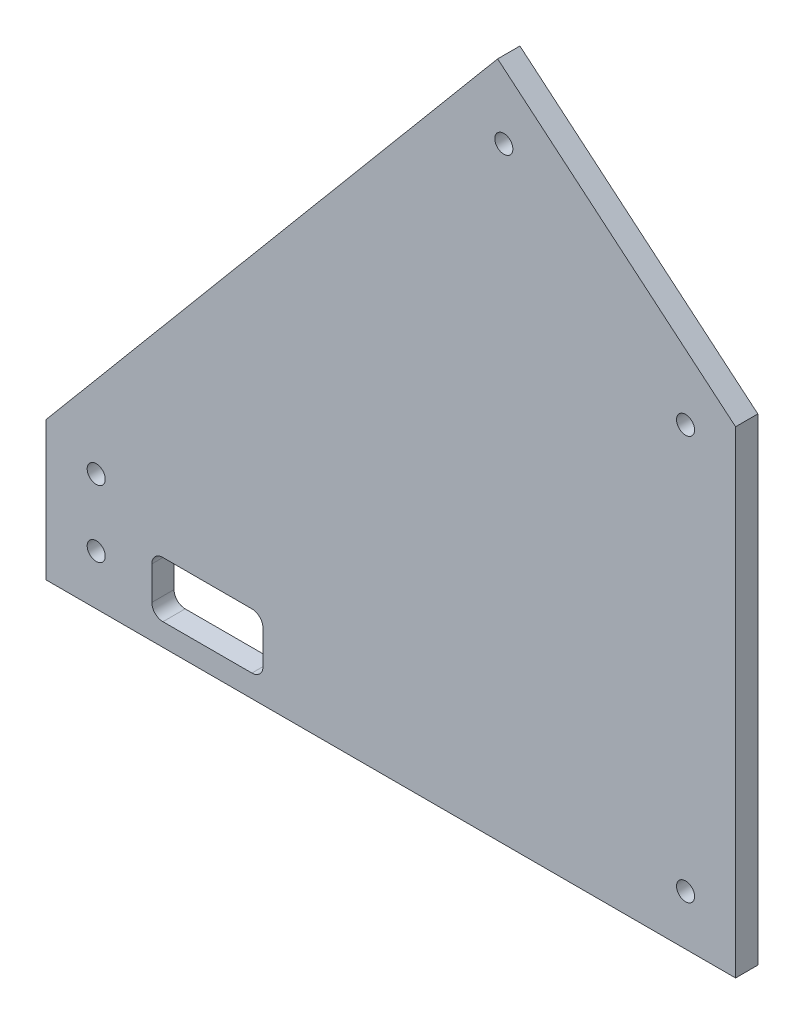
ISO-10303-21;
HEADER;
FILE_DESCRIPTION(('STEP AP214'),'2;1');
FILE_NAME('part.step','',(''),(''),'','','');
FILE_SCHEMA(('AUTOMOTIVE_DESIGN { 1 0 10303 214 1 1 1 1 }'));
ENDSEC;
DATA;
#1=APPLICATION_CONTEXT('core data for automotive mechanical design processes');
#2=APPLICATION_PROTOCOL_DEFINITION('international standard','automotive_design',2000,#1);
#3=PRODUCT_CONTEXT('',#1,'mechanical');
#4=PRODUCT('Part','Part','',(#3));
#5=PRODUCT_RELATED_PRODUCT_CATEGORY('part','',(#4));
#6=PRODUCT_DEFINITION_FORMATION('','',#4);
#7=PRODUCT_DEFINITION_CONTEXT('part definition',#1,'design');
#8=PRODUCT_DEFINITION('design','',#6,#7);
#9=PRODUCT_DEFINITION_SHAPE('','',#8);
#10=(LENGTH_UNIT() NAMED_UNIT(*) SI_UNIT(.MILLI.,.METRE.));
#11=(NAMED_UNIT(*) PLANE_ANGLE_UNIT() SI_UNIT($,.RADIAN.));
#12=(NAMED_UNIT(*) SI_UNIT($,.STERADIAN.) SOLID_ANGLE_UNIT());
#13=UNCERTAINTY_MEASURE_WITH_UNIT(LENGTH_MEASURE(1.E-05),#10,'distance_accuracy_value','');
#14=(GEOMETRIC_REPRESENTATION_CONTEXT(3) GLOBAL_UNCERTAINTY_ASSIGNED_CONTEXT((#13)) GLOBAL_UNIT_ASSIGNED_CONTEXT((#10,
#11,#12)) REPRESENTATION_CONTEXT('',''));
#15=CARTESIAN_POINT('',(0.,0.,0.));
#16=DIRECTION('',(0.,0.,1.));
#17=DIRECTION('',(1.,0.,0.));
#18=AXIS2_PLACEMENT_3D('',#15,#16,#17);
#19=CARTESIAN_POINT('',(0.,9.99999999999999,4.));
#20=DIRECTION('',(0.,1.,0.));
#21=DIRECTION('',(0.,0.,1.));
#22=AXIS2_PLACEMENT_3D('',#19,#20,#21);
#23=PLANE('',#22);
#24=DIRECTION('',(1.,0.,0.));
#25=VECTOR('',#24,1.);
#26=CARTESIAN_POINT('',(0.,9.99999999999999,0.));
#27=LINE('',#26,#25);
#28=CARTESIAN_POINT('',(-99.,9.99999999999999,0.));
#29=VERTEX_POINT('',#28);
#30=CARTESIAN_POINT('',(-83.,9.99999999999999,0.));
#31=VERTEX_POINT('',#30);
#32=EDGE_CURVE('E220',#29,#31,#27,.T.);
#33=ORIENTED_EDGE('',*,*,#32,.T.);
#34=DIRECTION('',(0.,0.,-1.));
#35=VECTOR('',#34,1.);
#36=CARTESIAN_POINT('',(-83.,9.99999999999999,4.));
#37=LINE('',#36,#35);
#38=CARTESIAN_POINT('',(-83.,9.99999999999999,4.));
#39=VERTEX_POINT('',#38);
#40=EDGE_CURVE('E245',#31,#39,#37,.F.);
#41=ORIENTED_EDGE('',*,*,#40,.T.);
#42=DIRECTION('',(1.,0.,0.));
#43=VECTOR('',#42,1.);
#44=CARTESIAN_POINT('',(0.,9.99999999999999,4.));
#45=LINE('',#44,#43);
#46=CARTESIAN_POINT('',(-99.,9.99999999999999,4.));
#47=VERTEX_POINT('',#46);
#48=EDGE_CURVE('E181',#47,#39,#45,.T.);
#49=ORIENTED_EDGE('',*,*,#48,.F.);
#50=DIRECTION('',(0.,0.,-1.));
#51=VECTOR('',#50,1.);
#52=CARTESIAN_POINT('',(-99.,9.99999999999999,4.));
#53=LINE('',#52,#51);
#54=EDGE_CURVE('E242',#47,#29,#53,.T.);
#55=ORIENTED_EDGE('',*,*,#54,.T.);
#56=EDGE_LOOP('',(#33,#41,#49,#55));
#57=FACE_BOUND('',#56,.T.);
#58=ADVANCED_FACE('F37',(#57),#23,.F.);
#59=CARTESIAN_POINT('',(-81.,0.,4.));
#60=DIRECTION('',(1.,0.,0.));
#61=DIRECTION('',(0.,0.,-1.));
#62=AXIS2_PLACEMENT_3D('',#59,#60,#61);
#63=PLANE('',#62);
#64=DIRECTION('',(0.,-1.,0.));
#65=VECTOR('',#64,1.);
#66=CARTESIAN_POINT('',(-81.,0.,4.));
#67=LINE('',#66,#65);
#68=CARTESIAN_POINT('',(-81.,7.99999999999999,4.));
#69=VERTEX_POINT('',#68);
#70=CARTESIAN_POINT('',(-81.,2.,4.));
#71=VERTEX_POINT('',#70);
#72=EDGE_CURVE('E184',#69,#71,#67,.T.);
#73=ORIENTED_EDGE('',*,*,#72,.F.);
#74=DIRECTION('',(0.,0.,-1.));
#75=VECTOR('',#74,1.);
#76=CARTESIAN_POINT('',(-81.,7.99999999999999,0.));
#77=LINE('',#76,#75);
#78=CARTESIAN_POINT('',(-81.,7.99999999999999,0.));
#79=VERTEX_POINT('',#78);
#80=EDGE_CURVE('E239',#69,#79,#77,.T.);
#81=ORIENTED_EDGE('',*,*,#80,.T.);
#82=DIRECTION('',(0.,-1.,0.));
#83=VECTOR('',#82,1.);
#84=CARTESIAN_POINT('',(-81.,0.,0.));
#85=LINE('',#84,#83);
#86=CARTESIAN_POINT('',(-81.,2.,0.));
#87=VERTEX_POINT('',#86);
#88=EDGE_CURVE('E223',#79,#87,#85,.T.);
#89=ORIENTED_EDGE('',*,*,#88,.T.);
#90=DIRECTION('',(0.,0.,-1.));
#91=VECTOR('',#90,1.);
#92=CARTESIAN_POINT('',(-81.,2.,4.));
#93=LINE('',#92,#91);
#94=EDGE_CURVE('E144',#87,#71,#93,.F.);
#95=ORIENTED_EDGE('',*,*,#94,.T.);
#96=EDGE_LOOP('',(#73,#81,#89,#95));
#97=FACE_BOUND('',#96,.T.);
#98=ADVANCED_FACE('F284',(#97),#63,.F.);
#99=CARTESIAN_POINT('',(0.,0.,4.));
#100=DIRECTION('',(0.,1.,0.));
#101=DIRECTION('',(-1.,0.,0.));
#102=AXIS2_PLACEMENT_3D('',#99,#100,#101);
#103=PLANE('',#102);
#104=DIRECTION('',(1.,0.,0.));
#105=VECTOR('',#104,1.);
#106=CARTESIAN_POINT('',(0.,0.,4.));
#107=LINE('',#106,#105);
#108=CARTESIAN_POINT('',(-99.,0.,4.));
#109=VERTEX_POINT('',#108);
#110=CARTESIAN_POINT('',(-83.,0.,4.));
#111=VERTEX_POINT('',#110);
#112=EDGE_CURVE('E187',#109,#111,#107,.T.);
#113=ORIENTED_EDGE('',*,*,#112,.T.);
#114=DIRECTION('',(0.,0.,-1.));
#115=VECTOR('',#114,1.);
#116=CARTESIAN_POINT('',(-83.,0.,4.));
#117=LINE('',#116,#115);
#118=CARTESIAN_POINT('',(-83.,0.,0.));
#119=VERTEX_POINT('',#118);
#120=EDGE_CURVE('E249',#111,#119,#117,.T.);
#121=ORIENTED_EDGE('',*,*,#120,.T.);
#122=DIRECTION('',(1.,0.,0.));
#123=VECTOR('',#122,1.);
#124=CARTESIAN_POINT('',(0.,0.,0.));
#125=LINE('',#124,#123);
#126=CARTESIAN_POINT('',(-99.,0.,0.));
#127=VERTEX_POINT('',#126);
#128=EDGE_CURVE('E226',#127,#119,#125,.T.);
#129=ORIENTED_EDGE('',*,*,#128,.F.);
#130=DIRECTION('',(0.,0.,-1.));
#131=VECTOR('',#130,1.);
#132=CARTESIAN_POINT('',(-99.,0.,4.));
#133=LINE('',#132,#131);
#134=EDGE_CURVE('E247',#127,#109,#133,.F.);
#135=ORIENTED_EDGE('',*,*,#134,.T.);
#136=EDGE_LOOP('',(#113,#121,#129,#135));
#137=FACE_BOUND('',#136,.T.);
#138=ADVANCED_FACE('F291',(#137),#103,.T.);
#139=CARTESIAN_POINT('',(4.,0.,4.));
#140=DIRECTION('',(1.,0.,0.));
#141=DIRECTION('',(0.,1.,0.));
#142=AXIS2_PLACEMENT_3D('',#139,#140,#141);
#143=PLANE('',#142);
#144=DIRECTION('',(0.,-1.,0.));
#145=VECTOR('',#144,1.);
#146=CARTESIAN_POINT('',(4.,0.,0.));
#147=LINE('',#146,#145);
#148=CARTESIAN_POINT('',(3.99999999999999,81.86523063262,0.));
#149=VERTEX_POINT('',#148);
#150=CARTESIAN_POINT('',(4.,-4.,0.));
#151=VERTEX_POINT('',#150);
#152=EDGE_CURVE('E139',#149,#151,#147,.T.);
#153=ORIENTED_EDGE('',*,*,#152,.F.);
#154=DIRECTION('',(0.,0.,-1.));
#155=VECTOR('',#154,1.);
#156=CARTESIAN_POINT('',(3.99999999999999,81.86523063262,4.));
#157=LINE('',#156,#155);
#158=CARTESIAN_POINT('',(3.99999999999999,81.86523063262,4.));
#159=VERTEX_POINT('',#158);
#160=EDGE_CURVE('E133',#159,#149,#157,.T.);
#161=ORIENTED_EDGE('',*,*,#160,.F.);
#162=DIRECTION('',(0.,-1.,0.));
#163=VECTOR('',#162,1.);
#164=CARTESIAN_POINT('',(4.,0.,4.));
#165=LINE('',#164,#163);
#166=CARTESIAN_POINT('',(4.,-4.,4.));
#167=VERTEX_POINT('',#166);
#168=EDGE_CURVE('E136',#159,#167,#165,.T.);
#169=ORIENTED_EDGE('',*,*,#168,.T.);
#170=DIRECTION('',(0.,0.,-1.));
#171=VECTOR('',#170,1.);
#172=CARTESIAN_POINT('',(4.,-4.,4.));
#173=LINE('',#172,#171);
#174=EDGE_CURVE('E192',#167,#151,#173,.T.);
#175=ORIENTED_EDGE('',*,*,#174,.T.);
#176=EDGE_LOOP('',(#153,#161,#169,#175));
#177=FACE_BOUND('',#176,.T.);
#178=ADVANCED_FACE('F135',(#177),#143,.T.);
#179=CARTESIAN_POINT('',(41.9634605592344,50.0101048791536,4.));
#180=DIRECTION('',(0.642787609686535,0.766044443118982,0.));
#181=DIRECTION('',(-0.766044443118982,0.642787609686535,0.));
#182=AXIS2_PLACEMENT_3D('',#179,#180,#181);
#183=PLANE('',#182);
#184=DIRECTION('',(0.766044443118982,-0.642787609686535,0.));
#185=VECTOR('',#184,1.);
#186=CARTESIAN_POINT('',(41.9634605592344,50.0101048791536,0.));
#187=LINE('',#186,#185);
#188=CARTESIAN_POINT('',(-38.7952494896789,117.774708695549,0.));
#189=VERTEX_POINT('',#188);
#190=EDGE_CURVE('E197',#189,#149,#187,.T.);
#191=ORIENTED_EDGE('',*,*,#190,.F.);
#192=DIRECTION('',(0.,0.,-1.));
#193=VECTOR('',#192,1.);
#194=CARTESIAN_POINT('',(-38.7952494896789,117.774708695549,4.));
#195=LINE('',#194,#193);
#196=CARTESIAN_POINT('',(-38.7952494896789,117.774708695549,4.));
#197=VERTEX_POINT('',#196);
#198=EDGE_CURVE('E145',#197,#189,#195,.T.);
#199=ORIENTED_EDGE('',*,*,#198,.F.);
#200=DIRECTION('',(0.766044443118982,-0.642787609686535,0.));
#201=VECTOR('',#200,1.);
#202=CARTESIAN_POINT('',(41.9634605592344,50.0101048791536,4.));
#203=LINE('',#202,#201);
#204=EDGE_CURVE('E152',#197,#159,#203,.T.);
#205=ORIENTED_EDGE('',*,*,#204,.T.);
#206=ORIENTED_EDGE('',*,*,#160,.T.);
#207=EDGE_LOOP('',(#191,#199,#205,#206));
#208=FACE_BOUND('',#207,.T.);
#209=ADVANCED_FACE('F159',(#208),#183,.T.);
#210=CARTESIAN_POINT('',(-80.7587100489132,67.7646038163952,4.));
#211=DIRECTION('',(-0.766044443118982,0.642787609686535,0.));
#212=DIRECTION('',(-0.642787609686535,-0.766044443118982,0.));
#213=AXIS2_PLACEMENT_3D('',#210,#211,#212);
#214=PLANE('',#213);
#215=DIRECTION('',(0.642787609686535,0.766044443118982,0.));
#216=VECTOR('',#215,1.);
#217=CARTESIAN_POINT('',(-80.7587100489132,67.7646038163952,0.));
#218=LINE('',#217,#216);
#219=CARTESIAN_POINT('',(-120.,20.998655539156,0.));
#220=VERTEX_POINT('',#219);
#221=EDGE_CURVE('E199',#220,#189,#218,.T.);
#222=ORIENTED_EDGE('',*,*,#221,.F.);
#223=DIRECTION('',(0.,0.,-1.));
#224=VECTOR('',#223,1.);
#225=CARTESIAN_POINT('',(-120.,20.998655539156,4.));
#226=LINE('',#225,#224);
#227=CARTESIAN_POINT('',(-120.,20.998655539156,4.));
#228=VERTEX_POINT('',#227);
#229=EDGE_CURVE('E235',#228,#220,#226,.T.);
#230=ORIENTED_EDGE('',*,*,#229,.F.);
#231=DIRECTION('',(0.642787609686535,0.766044443118982,0.));
#232=VECTOR('',#231,1.);
#233=CARTESIAN_POINT('',(-80.7587100489132,67.7646038163952,4.));
#234=LINE('',#233,#232);
#235=EDGE_CURVE('E160',#228,#197,#234,.T.);
#236=ORIENTED_EDGE('',*,*,#235,.T.);
#237=ORIENTED_EDGE('',*,*,#198,.T.);
#238=EDGE_LOOP('',(#222,#230,#236,#237));
#239=FACE_BOUND('',#238,.T.);
#240=ADVANCED_FACE('F334',(#239),#214,.T.);
#241=CARTESIAN_POINT('',(-120.,0.,4.));
#242=DIRECTION('',(-1.,0.,0.));
#243=DIRECTION('',(0.,0.,1.));
#244=AXIS2_PLACEMENT_3D('',#241,#242,#243);
#245=PLANE('',#244);
#246=DIRECTION('',(0.,1.,0.));
#247=VECTOR('',#246,1.);
#248=CARTESIAN_POINT('',(-120.,0.,0.));
#249=LINE('',#248,#247);
#250=CARTESIAN_POINT('',(-120.,-4.00000000000002,0.));
#251=VERTEX_POINT('',#250);
#252=EDGE_CURVE('E202',#251,#220,#249,.T.);
#253=ORIENTED_EDGE('',*,*,#252,.F.);
#254=DIRECTION('',(0.,0.,-1.));
#255=VECTOR('',#254,1.);
#256=CARTESIAN_POINT('',(-120.,-4.00000000000002,4.));
#257=LINE('',#256,#255);
#258=CARTESIAN_POINT('',(-120.,-4.00000000000002,4.));
#259=VERTEX_POINT('',#258);
#260=EDGE_CURVE('E233',#259,#251,#257,.T.);
#261=ORIENTED_EDGE('',*,*,#260,.F.);
#262=DIRECTION('',(0.,1.,0.));
#263=VECTOR('',#262,1.);
#264=CARTESIAN_POINT('',(-120.,0.,4.));
#265=LINE('',#264,#263);
#266=EDGE_CURVE('E162',#259,#228,#265,.T.);
#267=ORIENTED_EDGE('',*,*,#266,.T.);
#268=ORIENTED_EDGE('',*,*,#229,.T.);
#269=EDGE_LOOP('',(#253,#261,#267,#268));
#270=FACE_BOUND('',#269,.T.);
#271=ADVANCED_FACE('F314',(#270),#245,.T.);
#272=CARTESIAN_POINT('',(-5.,5.,4.));
#273=DIRECTION('',(0.,0.,-1.));
#274=DIRECTION('',(-1.,0.,0.));
#275=AXIS2_PLACEMENT_3D('',#272,#273,#274);
#276=CYLINDRICAL_SURFACE('',#275,1.625);
#277=CARTESIAN_POINT('',(-5.,5.,4.));
#278=DIRECTION('',(0.,0.,1.));
#279=DIRECTION('',(1.,0.,0.));
#280=AXIS2_PLACEMENT_3D('',#277,#278,#279);
#281=CIRCLE('',#280,1.625);
#282=CARTESIAN_POINT('',(-3.375,5.,4.));
#283=VERTEX_POINT('',#282);
#284=EDGE_CURVE('E178',#283,#283,#281,.T.);
#285=ORIENTED_EDGE('',*,*,#284,.T.);
#286=EDGE_LOOP('',(#285));
#287=FACE_BOUND('',#286,.T.);
#288=CARTESIAN_POINT('',(-5.,5.,0.));
#289=DIRECTION('',(0.,0.,1.));
#290=DIRECTION('',(1.,0.,0.));
#291=AXIS2_PLACEMENT_3D('',#288,#289,#290);
#292=CIRCLE('',#291,1.625);
#293=CARTESIAN_POINT('',(-3.375,5.,0.));
#294=VERTEX_POINT('',#293);
#295=EDGE_CURVE('E217',#294,#294,#292,.T.);
#296=ORIENTED_EDGE('',*,*,#295,.F.);
#297=EDGE_LOOP('',(#296));
#298=FACE_BOUND('',#297,.T.);
#299=ADVANCED_FACE('F310',(#287,#298),#276,.F.);
#300=CARTESIAN_POINT('',(-111.,17.,4.));
#301=DIRECTION('',(0.,0.,-1.));
#302=DIRECTION('',(-1.,0.,0.));
#303=AXIS2_PLACEMENT_3D('',#300,#301,#302);
#304=CYLINDRICAL_SURFACE('',#303,1.625);
#305=CARTESIAN_POINT('',(-111.,17.,4.));
#306=DIRECTION('',(0.,0.,1.));
#307=DIRECTION('',(1.,0.,0.));
#308=AXIS2_PLACEMENT_3D('',#305,#306,#307);
#309=CIRCLE('',#308,1.625);
#310=CARTESIAN_POINT('',(-109.375,17.,4.));
#311=VERTEX_POINT('',#310);
#312=EDGE_CURVE('E175',#311,#311,#309,.T.);
#313=ORIENTED_EDGE('',*,*,#312,.T.);
#314=EDGE_LOOP('',(#313));
#315=FACE_BOUND('',#314,.T.);
#316=CARTESIAN_POINT('',(-111.,17.,0.));
#317=DIRECTION('',(0.,0.,1.));
#318=DIRECTION('',(1.,0.,0.));
#319=AXIS2_PLACEMENT_3D('',#316,#317,#318);
#320=CIRCLE('',#319,1.625);
#321=CARTESIAN_POINT('',(-109.375,17.,0.));
#322=VERTEX_POINT('',#321);
#323=EDGE_CURVE('E214',#322,#322,#320,.T.);
#324=ORIENTED_EDGE('',*,*,#323,.F.);
#325=EDGE_LOOP('',(#324));
#326=FACE_BOUND('',#325,.T.);
#327=ADVANCED_FACE('F313',(#315,#326),#304,.F.);
#328=CARTESIAN_POINT('',(-37.6859379887868,105.095220220299,4.));
#329=DIRECTION('',(0.,0.,-1.));
#330=DIRECTION('',(-1.,0.,0.));
#331=AXIS2_PLACEMENT_3D('',#328,#329,#330);
#332=CYLINDRICAL_SURFACE('',#331,1.625);
#333=CARTESIAN_POINT('',(-37.6859379887868,105.095220220299,4.));
#334=DIRECTION('',(0.,0.,1.));
#335=DIRECTION('',(1.,0.,0.));
#336=AXIS2_PLACEMENT_3D('',#333,#334,#335);
#337=CIRCLE('',#336,1.625);
#338=CARTESIAN_POINT('',(-36.0609379887868,105.095220220299,4.));
#339=VERTEX_POINT('',#338);
#340=EDGE_CURVE('E172',#339,#339,#337,.T.);
#341=ORIENTED_EDGE('',*,*,#340,.T.);
#342=EDGE_LOOP('',(#341));
#343=FACE_BOUND('',#342,.T.);
#344=CARTESIAN_POINT('',(-37.6859379887868,105.095220220299,0.));
#345=DIRECTION('',(0.,0.,1.));
#346=DIRECTION('',(1.,0.,0.));
#347=AXIS2_PLACEMENT_3D('',#344,#345,#346);
#348=CIRCLE('',#347,1.625);
#349=CARTESIAN_POINT('',(-36.0609379887868,105.095220220299,0.));
#350=VERTEX_POINT('',#349);
#351=EDGE_CURVE('E211',#350,#350,#348,.T.);
#352=ORIENTED_EDGE('',*,*,#351,.F.);
#353=EDGE_LOOP('',(#352));
#354=FACE_BOUND('',#353,.T.);
#355=ADVANCED_FACE('F318',(#343,#354),#332,.F.);
#356=CARTESIAN_POINT('',(-4.99999999999999,77.668461709225,4.));
#357=DIRECTION('',(0.,0.,-1.));
#358=DIRECTION('',(-1.,0.,0.));
#359=AXIS2_PLACEMENT_3D('',#356,#357,#358);
#360=CYLINDRICAL_SURFACE('',#359,1.625);
#361=CARTESIAN_POINT('',(-4.99999999999999,77.668461709225,4.));
#362=DIRECTION('',(0.,0.,1.));
#363=DIRECTION('',(1.,0.,0.));
#364=AXIS2_PLACEMENT_3D('',#361,#362,#363);
#365=CIRCLE('',#364,1.625);
#366=CARTESIAN_POINT('',(-3.37499999999999,77.668461709225,4.));
#367=VERTEX_POINT('',#366);
#368=EDGE_CURVE('E169',#367,#367,#365,.T.);
#369=ORIENTED_EDGE('',*,*,#368,.T.);
#370=EDGE_LOOP('',(#369));
#371=FACE_BOUND('',#370,.T.);
#372=CARTESIAN_POINT('',(-4.99999999999999,77.668461709225,0.));
#373=DIRECTION('',(0.,0.,1.));
#374=DIRECTION('',(1.,0.,0.));
#375=AXIS2_PLACEMENT_3D('',#372,#373,#374);
#376=CIRCLE('',#375,1.625);
#377=CARTESIAN_POINT('',(-3.37499999999999,77.668461709225,0.));
#378=VERTEX_POINT('',#377);
#379=EDGE_CURVE('E208',#378,#378,#376,.T.);
#380=ORIENTED_EDGE('',*,*,#379,.F.);
#381=EDGE_LOOP('',(#380));
#382=FACE_BOUND('',#381,.T.);
#383=ADVANCED_FACE('F322',(#371,#382),#360,.F.);
#384=CARTESIAN_POINT('',(0.,-4.,4.));
#385=DIRECTION('',(0.,-1.,0.));
#386=DIRECTION('',(1.,0.,0.));
#387=AXIS2_PLACEMENT_3D('',#384,#385,#386);
#388=PLANE('',#387);
#389=DIRECTION('',(-1.,0.,0.));
#390=VECTOR('',#389,1.);
#391=CARTESIAN_POINT('',(0.,-4.,0.));
#392=LINE('',#391,#390);
#393=EDGE_CURVE('E205',#151,#251,#392,.T.);
#394=ORIENTED_EDGE('',*,*,#393,.F.);
#395=ORIENTED_EDGE('',*,*,#174,.F.);
#396=DIRECTION('',(-1.,0.,0.));
#397=VECTOR('',#396,1.);
#398=CARTESIAN_POINT('',(0.,-4.,4.));
#399=LINE('',#398,#397);
#400=EDGE_CURVE('E156',#167,#259,#399,.T.);
#401=ORIENTED_EDGE('',*,*,#400,.T.);
#402=ORIENTED_EDGE('',*,*,#260,.T.);
#403=EDGE_LOOP('',(#394,#395,#401,#402));
#404=FACE_BOUND('',#403,.T.);
#405=ADVANCED_FACE('F326',(#404),#388,.T.);
#406=CARTESIAN_POINT('',(-111.,5.,4.));
#407=DIRECTION('',(0.,0.,-1.));
#408=DIRECTION('',(-1.,0.,0.));
#409=AXIS2_PLACEMENT_3D('',#406,#407,#408);
#410=CYLINDRICAL_SURFACE('',#409,1.625);
#411=CARTESIAN_POINT('',(-111.,5.,4.));
#412=DIRECTION('',(0.,0.,1.));
#413=DIRECTION('',(1.,0.,0.));
#414=AXIS2_PLACEMENT_3D('',#411,#412,#413);
#415=CIRCLE('',#414,1.625);
#416=CARTESIAN_POINT('',(-109.375,5.,4.));
#417=VERTEX_POINT('',#416);
#418=EDGE_CURVE('E157',#417,#417,#415,.T.);
#419=ORIENTED_EDGE('',*,*,#418,.T.);
#420=EDGE_LOOP('',(#419));
#421=FACE_BOUND('',#420,.T.);
#422=CARTESIAN_POINT('',(-111.,5.,0.));
#423=DIRECTION('',(0.,0.,1.));
#424=DIRECTION('',(1.,0.,0.));
#425=AXIS2_PLACEMENT_3D('',#422,#423,#424);
#426=CIRCLE('',#425,1.625);
#427=CARTESIAN_POINT('',(-109.375,5.,0.));
#428=VERTEX_POINT('',#427);
#429=EDGE_CURVE('E193',#428,#428,#426,.T.);
#430=ORIENTED_EDGE('',*,*,#429,.F.);
#431=EDGE_LOOP('',(#430));
#432=FACE_BOUND('',#431,.T.);
#433=ADVANCED_FACE('F330',(#421,#432),#410,.F.);
#434=CARTESIAN_POINT('',(-101.,0.,4.));
#435=DIRECTION('',(1.,0.,0.));
#436=DIRECTION('',(0.,0.,-1.));
#437=AXIS2_PLACEMENT_3D('',#434,#435,#436);
#438=PLANE('',#437);
#439=DIRECTION('',(0.,-1.,0.));
#440=VECTOR('',#439,1.);
#441=CARTESIAN_POINT('',(-101.,0.,4.));
#442=LINE('',#441,#440);
#443=CARTESIAN_POINT('',(-101.,7.99999999999999,4.));
#444=VERTEX_POINT('',#443);
#445=CARTESIAN_POINT('',(-101.,2.,4.));
#446=VERTEX_POINT('',#445);
#447=EDGE_CURVE('E190',#444,#446,#442,.T.);
#448=ORIENTED_EDGE('',*,*,#447,.T.);
#449=DIRECTION('',(0.,0.,-1.));
#450=VECTOR('',#449,1.);
#451=CARTESIAN_POINT('',(-101.,2.,0.));
#452=LINE('',#451,#450);
#453=CARTESIAN_POINT('',(-101.,2.,0.));
#454=VERTEX_POINT('',#453);
#455=EDGE_CURVE('E253',#446,#454,#452,.T.);
#456=ORIENTED_EDGE('',*,*,#455,.T.);
#457=DIRECTION('',(0.,-1.,0.));
#458=VECTOR('',#457,1.);
#459=CARTESIAN_POINT('',(-101.,0.,0.));
#460=LINE('',#459,#458);
#461=CARTESIAN_POINT('',(-101.,7.99999999999999,0.));
#462=VERTEX_POINT('',#461);
#463=EDGE_CURVE('E229',#462,#454,#460,.T.);
#464=ORIENTED_EDGE('',*,*,#463,.F.);
#465=DIRECTION('',(0.,0.,-1.));
#466=VECTOR('',#465,1.);
#467=CARTESIAN_POINT('',(-101.,7.99999999999999,4.));
#468=LINE('',#467,#466);
#469=EDGE_CURVE('E59',#462,#444,#468,.F.);
#470=ORIENTED_EDGE('',*,*,#469,.T.);
#471=EDGE_LOOP('',(#448,#456,#464,#470));
#472=FACE_BOUND('',#471,.T.);
#473=ADVANCED_FACE('F271',(#472),#438,.T.);
#474=CARTESIAN_POINT('',(0.,0.,4.));
#475=DIRECTION('',(0.,0.,1.));
#476=DIRECTION('',(1.,0.,0.));
#477=AXIS2_PLACEMENT_3D('',#474,#475,#476);
#478=PLANE('',#477);
#479=ORIENTED_EDGE('',*,*,#418,.F.);
#480=EDGE_LOOP('',(#479));
#481=FACE_BOUND('',#480,.T.);
#482=ORIENTED_EDGE('',*,*,#168,.F.);
#483=ORIENTED_EDGE('',*,*,#204,.F.);
#484=ORIENTED_EDGE('',*,*,#235,.F.);
#485=ORIENTED_EDGE('',*,*,#266,.F.);
#486=ORIENTED_EDGE('',*,*,#400,.F.);
#487=EDGE_LOOP('',(#482,#483,#484,#485,#486));
#488=FACE_BOUND('',#487,.T.);
#489=ORIENTED_EDGE('',*,*,#368,.F.);
#490=EDGE_LOOP('',(#489));
#491=FACE_BOUND('',#490,.T.);
#492=ORIENTED_EDGE('',*,*,#340,.F.);
#493=EDGE_LOOP('',(#492));
#494=FACE_BOUND('',#493,.T.);
#495=ORIENTED_EDGE('',*,*,#312,.F.);
#496=EDGE_LOOP('',(#495));
#497=FACE_BOUND('',#496,.T.);
#498=ORIENTED_EDGE('',*,*,#284,.F.);
#499=EDGE_LOOP('',(#498));
#500=FACE_BOUND('',#499,.T.);
#501=ORIENTED_EDGE('',*,*,#447,.F.);
#502=CARTESIAN_POINT('',(-99.,7.99999999999999,4.));
#503=DIRECTION('',(0.,0.,1.));
#504=DIRECTION('',(1.,0.,0.));
#505=AXIS2_PLACEMENT_3D('',#502,#503,#504);
#506=CIRCLE('',#505,2.);
#507=EDGE_CURVE('E11',#444,#47,#506,.F.);
#508=ORIENTED_EDGE('',*,*,#507,.T.);
#509=ORIENTED_EDGE('',*,*,#48,.T.);
#510=CARTESIAN_POINT('',(-83.,7.99999999999999,4.));
#511=DIRECTION('',(0.,0.,1.));
#512=DIRECTION('',(1.,0.,0.));
#513=AXIS2_PLACEMENT_3D('',#510,#511,#512);
#514=CIRCLE('',#513,2.);
#515=EDGE_CURVE('E258',#39,#69,#514,.F.);
#516=ORIENTED_EDGE('',*,*,#515,.T.);
#517=ORIENTED_EDGE('',*,*,#72,.T.);
#518=CARTESIAN_POINT('',(-83.,2.,4.));
#519=DIRECTION('',(0.,0.,1.));
#520=DIRECTION('',(1.,0.,0.));
#521=AXIS2_PLACEMENT_3D('',#518,#519,#520);
#522=CIRCLE('',#521,2.);
#523=EDGE_CURVE('E262',#71,#111,#522,.F.);
#524=ORIENTED_EDGE('',*,*,#523,.T.);
#525=ORIENTED_EDGE('',*,*,#112,.F.);
#526=CARTESIAN_POINT('',(-99.,2.,4.));
#527=DIRECTION('',(0.,0.,1.));
#528=DIRECTION('',(1.,0.,0.));
#529=AXIS2_PLACEMENT_3D('',#526,#527,#528);
#530=CIRCLE('',#529,2.);
#531=EDGE_CURVE('E52',#109,#446,#530,.F.);
#532=ORIENTED_EDGE('',*,*,#531,.T.);
#533=EDGE_LOOP('',(#501,#508,#509,#516,#517,#524,#525,#532));
#534=FACE_BOUND('',#533,.T.);
#535=ADVANCED_FACE('F149',(#481,#488,#491,#494,#497,#500,#534),#478,.T.);
#536=CARTESIAN_POINT('',(0.,0.,0.));
#537=DIRECTION('',(0.,0.,1.));
#538=DIRECTION('',(1.,0.,0.));
#539=AXIS2_PLACEMENT_3D('',#536,#537,#538);
#540=PLANE('',#539);
#541=ORIENTED_EDGE('',*,*,#429,.T.);
#542=EDGE_LOOP('',(#541));
#543=FACE_BOUND('',#542,.T.);
#544=ORIENTED_EDGE('',*,*,#152,.T.);
#545=ORIENTED_EDGE('',*,*,#393,.T.);
#546=ORIENTED_EDGE('',*,*,#252,.T.);
#547=ORIENTED_EDGE('',*,*,#221,.T.);
#548=ORIENTED_EDGE('',*,*,#190,.T.);
#549=EDGE_LOOP('',(#544,#545,#546,#547,#548));
#550=FACE_BOUND('',#549,.T.);
#551=ORIENTED_EDGE('',*,*,#379,.T.);
#552=EDGE_LOOP('',(#551));
#553=FACE_BOUND('',#552,.T.);
#554=ORIENTED_EDGE('',*,*,#351,.T.);
#555=EDGE_LOOP('',(#554));
#556=FACE_BOUND('',#555,.T.);
#557=ORIENTED_EDGE('',*,*,#323,.T.);
#558=EDGE_LOOP('',(#557));
#559=FACE_BOUND('',#558,.T.);
#560=ORIENTED_EDGE('',*,*,#295,.T.);
#561=EDGE_LOOP('',(#560));
#562=FACE_BOUND('',#561,.T.);
#563=ORIENTED_EDGE('',*,*,#32,.F.);
#564=CARTESIAN_POINT('',(-99.,7.99999999999999,0.));
#565=DIRECTION('',(0.,0.,1.));
#566=DIRECTION('',(1.,0.,0.));
#567=AXIS2_PLACEMENT_3D('',#564,#565,#566);
#568=CIRCLE('',#567,2.);
#569=EDGE_CURVE('E45',#29,#462,#568,.T.);
#570=ORIENTED_EDGE('',*,*,#569,.T.);
#571=ORIENTED_EDGE('',*,*,#463,.T.);
#572=CARTESIAN_POINT('',(-99.,2.,0.));
#573=DIRECTION('',(0.,0.,1.));
#574=DIRECTION('',(1.,0.,0.));
#575=AXIS2_PLACEMENT_3D('',#572,#573,#574);
#576=CIRCLE('',#575,2.);
#577=EDGE_CURVE('E264',#454,#127,#576,.T.);
#578=ORIENTED_EDGE('',*,*,#577,.T.);
#579=ORIENTED_EDGE('',*,*,#128,.T.);
#580=CARTESIAN_POINT('',(-83.,2.,0.));
#581=DIRECTION('',(0.,0.,1.));
#582=DIRECTION('',(1.,0.,0.));
#583=AXIS2_PLACEMENT_3D('',#580,#581,#582);
#584=CIRCLE('',#583,2.);
#585=EDGE_CURVE('E260',#119,#87,#584,.T.);
#586=ORIENTED_EDGE('',*,*,#585,.T.);
#587=ORIENTED_EDGE('',*,*,#88,.F.);
#588=CARTESIAN_POINT('',(-83.,7.99999999999999,0.));
#589=DIRECTION('',(0.,0.,1.));
#590=DIRECTION('',(1.,0.,0.));
#591=AXIS2_PLACEMENT_3D('',#588,#589,#590);
#592=CIRCLE('',#591,2.);
#593=EDGE_CURVE('E256',#79,#31,#592,.T.);
#594=ORIENTED_EDGE('',*,*,#593,.T.);
#595=EDGE_LOOP('',(#563,#570,#571,#578,#579,#586,#587,#594));
#596=FACE_BOUND('',#595,.T.);
#597=ADVANCED_FACE('F268',(#543,#550,#553,#556,#559,#562,#596),#540,.F.);
#598=CARTESIAN_POINT('',(-83.,7.99999999999999,4.));
#599=DIRECTION('',(0.,0.,1.));
#600=DIRECTION('',(1.,0.,0.));
#601=AXIS2_PLACEMENT_3D('',#598,#599,#600);
#602=CYLINDRICAL_SURFACE('',#601,2.);
#603=ORIENTED_EDGE('',*,*,#515,.F.);
#604=ORIENTED_EDGE('',*,*,#40,.F.);
#605=ORIENTED_EDGE('',*,*,#593,.F.);
#606=ORIENTED_EDGE('',*,*,#80,.F.);
#607=EDGE_LOOP('',(#603,#604,#605,#606));
#608=FACE_BOUND('',#607,.T.);
#609=ADVANCED_FACE('F279',(#608),#602,.F.);
#610=CARTESIAN_POINT('',(-83.,2.,4.));
#611=DIRECTION('',(0.,0.,-1.));
#612=DIRECTION('',(-1.,0.,0.));
#613=AXIS2_PLACEMENT_3D('',#610,#611,#612);
#614=CYLINDRICAL_SURFACE('',#613,2.);
#615=ORIENTED_EDGE('',*,*,#523,.F.);
#616=ORIENTED_EDGE('',*,*,#94,.F.);
#617=ORIENTED_EDGE('',*,*,#585,.F.);
#618=ORIENTED_EDGE('',*,*,#120,.F.);
#619=EDGE_LOOP('',(#615,#616,#617,#618));
#620=FACE_BOUND('',#619,.T.);
#621=ADVANCED_FACE('F288',(#620),#614,.F.);
#622=CARTESIAN_POINT('',(-99.,2.,4.));
#623=DIRECTION('',(0.,0.,1.));
#624=DIRECTION('',(1.,0.,0.));
#625=AXIS2_PLACEMENT_3D('',#622,#623,#624);
#626=CYLINDRICAL_SURFACE('',#625,2.);
#627=ORIENTED_EDGE('',*,*,#531,.F.);
#628=ORIENTED_EDGE('',*,*,#134,.F.);
#629=ORIENTED_EDGE('',*,*,#577,.F.);
#630=ORIENTED_EDGE('',*,*,#455,.F.);
#631=EDGE_LOOP('',(#627,#628,#629,#630));
#632=FACE_BOUND('',#631,.T.);
#633=ADVANCED_FACE('F295',(#632),#626,.F.);
#634=CARTESIAN_POINT('',(-99.,7.99999999999999,4.));
#635=DIRECTION('',(0.,0.,-1.));
#636=DIRECTION('',(-1.,0.,0.));
#637=AXIS2_PLACEMENT_3D('',#634,#635,#636);
#638=CYLINDRICAL_SURFACE('',#637,2.);
#639=ORIENTED_EDGE('',*,*,#507,.F.);
#640=ORIENTED_EDGE('',*,*,#469,.F.);
#641=ORIENTED_EDGE('',*,*,#569,.F.);
#642=ORIENTED_EDGE('',*,*,#54,.F.);
#643=EDGE_LOOP('',(#639,#640,#641,#642));
#644=FACE_BOUND('',#643,.T.);
#645=ADVANCED_FACE('F39',(#644),#638,.F.);
#646=CLOSED_SHELL('',(#58,#98,#138,#178,#209,#240,#271,#299,#327,#355,#383,#405,#433,#473,#535,
#597,#609,#621,#633,#645));
#647=MANIFOLD_SOLID_BREP('B2',#646);
#648=ADVANCED_BREP_SHAPE_REPRESENTATION('',(#18,#647),#14);
#649=SHAPE_DEFINITION_REPRESENTATION(#9,#648);
ENDSEC;
END-ISO-10303-21;
